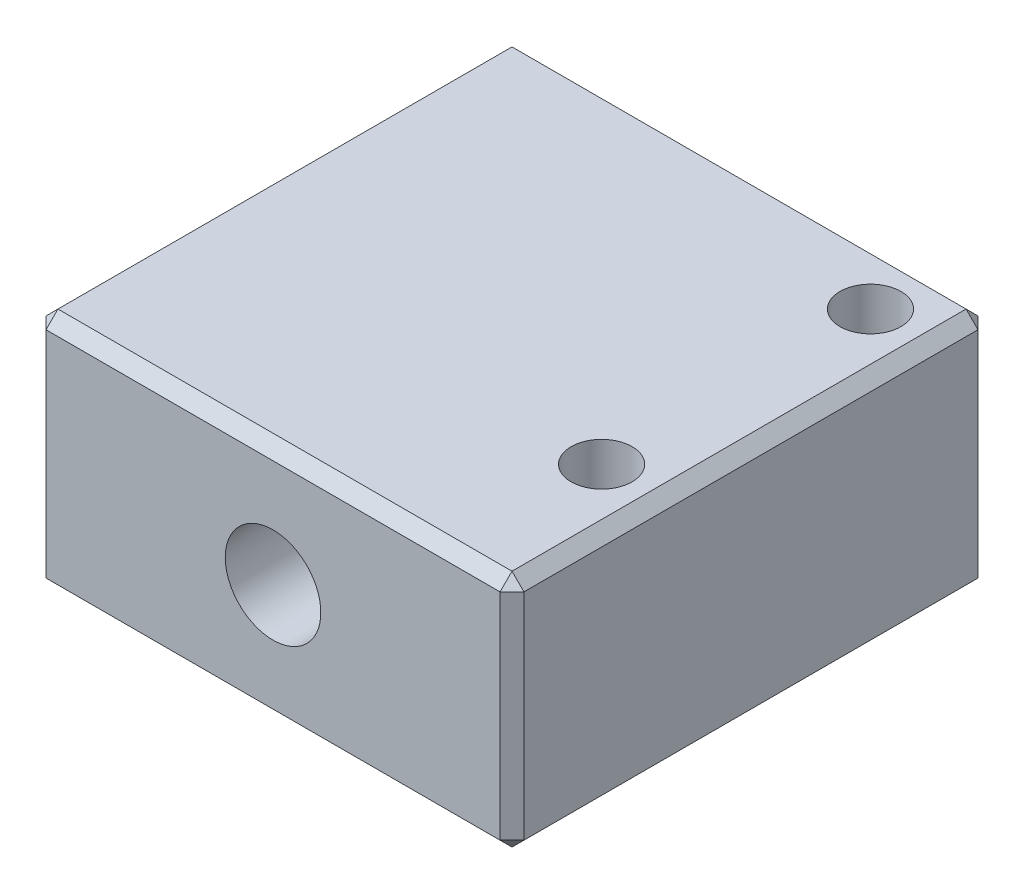
ISO-10303-21;
HEADER;
FILE_DESCRIPTION(('STEP AP214'),'2;1');
FILE_NAME('part.step','',(''),(''),'','','');
FILE_SCHEMA(('AUTOMOTIVE_DESIGN { 1 0 10303 214 1 1 1 1 }'));
ENDSEC;
DATA;
#1=APPLICATION_CONTEXT('core data for automotive mechanical design processes');
#2=APPLICATION_PROTOCOL_DEFINITION('international standard','automotive_design',2000,#1);
#3=PRODUCT_CONTEXT('',#1,'mechanical');
#4=PRODUCT('Part','Part','',(#3));
#5=PRODUCT_RELATED_PRODUCT_CATEGORY('part','',(#4));
#6=PRODUCT_DEFINITION_FORMATION('','',#4);
#7=PRODUCT_DEFINITION_CONTEXT('part definition',#1,'design');
#8=PRODUCT_DEFINITION('design','',#6,#7);
#9=PRODUCT_DEFINITION_SHAPE('','',#8);
#10=(LENGTH_UNIT() NAMED_UNIT(*) SI_UNIT(.MILLI.,.METRE.));
#11=(NAMED_UNIT(*) PLANE_ANGLE_UNIT() SI_UNIT($,.RADIAN.));
#12=(NAMED_UNIT(*) SI_UNIT($,.STERADIAN.) SOLID_ANGLE_UNIT());
#13=UNCERTAINTY_MEASURE_WITH_UNIT(LENGTH_MEASURE(1.E-05),#10,'distance_accuracy_value','');
#14=(GEOMETRIC_REPRESENTATION_CONTEXT(3) GLOBAL_UNCERTAINTY_ASSIGNED_CONTEXT((#13)) GLOBAL_UNIT_ASSIGNED_CONTEXT((#10,
#11,#12)) REPRESENTATION_CONTEXT('',''));
#15=CARTESIAN_POINT('',(0.,0.,0.));
#16=DIRECTION('',(0.,0.,1.));
#17=DIRECTION('',(1.,0.,0.));
#18=AXIS2_PLACEMENT_3D('',#15,#16,#17);
#19=CARTESIAN_POINT('',(20.,20.,20.));
#20=DIRECTION('',(-1.,0.,0.));
#21=DIRECTION('',(0.,0.,1.));
#22=AXIS2_PLACEMENT_3D('',#19,#20,#21);
#23=PLANE('',#22);
#24=DIRECTION('',(0.,0.,-1.));
#25=VECTOR('',#24,1.);
#26=CARTESIAN_POINT('',(20.,0.999999999999994,-20.));
#27=LINE('',#26,#25);
#28=CARTESIAN_POINT('',(20.,0.999999999999994,19.));
#29=VERTEX_POINT('',#28);
#30=CARTESIAN_POINT('',(20.,0.999999999999994,-19.));
#31=VERTEX_POINT('',#30);
#32=EDGE_CURVE('E223',#29,#31,#27,.T.);
#33=ORIENTED_EDGE('',*,*,#32,.T.);
#34=DIRECTION('',(0.,1.,0.));
#35=VECTOR('',#34,1.);
#36=CARTESIAN_POINT('',(20.,20.,-19.));
#37=LINE('',#36,#35);
#38=CARTESIAN_POINT('',(20.,19.,-19.));
#39=VERTEX_POINT('',#38);
#40=EDGE_CURVE('E225',#31,#39,#37,.T.);
#41=ORIENTED_EDGE('',*,*,#40,.T.);
#42=DIRECTION('',(0.,0.,1.));
#43=VECTOR('',#42,1.);
#44=CARTESIAN_POINT('',(20.,19.,20.));
#45=LINE('',#44,#43);
#46=CARTESIAN_POINT('',(20.,19.,19.));
#47=VERTEX_POINT('',#46);
#48=EDGE_CURVE('E219',#39,#47,#45,.T.);
#49=ORIENTED_EDGE('',*,*,#48,.T.);
#50=DIRECTION('',(0.,-1.,0.));
#51=VECTOR('',#50,1.);
#52=CARTESIAN_POINT('',(20.,20.,19.));
#53=LINE('',#52,#51);
#54=EDGE_CURVE('E221',#47,#29,#53,.T.);
#55=ORIENTED_EDGE('',*,*,#54,.T.);
#56=EDGE_LOOP('',(#33,#41,#49,#55));
#57=FACE_BOUND('',#56,.T.);
#58=ADVANCED_FACE('F37',(#57),#23,.F.);
#59=CARTESIAN_POINT('',(-20.,20.,-20.));
#60=DIRECTION('',(0.,0.,1.));
#61=DIRECTION('',(1.,0.,0.));
#62=AXIS2_PLACEMENT_3D('',#59,#60,#61);
#63=PLANE('',#62);
#64=CARTESIAN_POINT('',(0.,10.,-20.));
#65=DIRECTION('',(0.,0.,-1.));
#66=DIRECTION('',(-1.,0.,0.));
#67=AXIS2_PLACEMENT_3D('',#64,#65,#66);
#68=CIRCLE('',#67,4.);
#69=CARTESIAN_POINT('',(-4.,10.,-20.));
#70=VERTEX_POINT('',#69);
#71=EDGE_CURVE('E620',#70,#70,#68,.T.);
#72=ORIENTED_EDGE('',*,*,#71,.F.);
#73=EDGE_LOOP('',(#72));
#74=FACE_BOUND('',#73,.T.);
#75=DIRECTION('',(1.,0.,0.));
#76=VECTOR('',#75,1.);
#77=CARTESIAN_POINT('',(-20.,19.,-20.));
#78=LINE('',#77,#76);
#79=CARTESIAN_POINT('',(-19.,19.,-20.));
#80=VERTEX_POINT('',#79);
#81=CARTESIAN_POINT('',(19.,19.,-20.));
#82=VERTEX_POINT('',#81);
#83=EDGE_CURVE('E135',#80,#82,#78,.T.);
#84=ORIENTED_EDGE('',*,*,#83,.T.);
#85=DIRECTION('',(0.,-1.,0.));
#86=VECTOR('',#85,1.);
#87=CARTESIAN_POINT('',(19.,20.,-20.));
#88=LINE('',#87,#86);
#89=CARTESIAN_POINT('',(19.,0.999999999999994,-20.));
#90=VERTEX_POINT('',#89);
#91=EDGE_CURVE('E131',#82,#90,#88,.T.);
#92=ORIENTED_EDGE('',*,*,#91,.T.);
#93=DIRECTION('',(-1.,0.,0.));
#94=VECTOR('',#93,1.);
#95=CARTESIAN_POINT('',(-20.,0.999999999999994,-20.));
#96=LINE('',#95,#94);
#97=CARTESIAN_POINT('',(-19.,0.999999999999994,-20.));
#98=VERTEX_POINT('',#97);
#99=EDGE_CURVE('E125',#90,#98,#96,.T.);
#100=ORIENTED_EDGE('',*,*,#99,.T.);
#101=DIRECTION('',(0.,1.,0.));
#102=VECTOR('',#101,1.);
#103=CARTESIAN_POINT('',(-19.,20.,-20.));
#104=LINE('',#103,#102);
#105=EDGE_CURVE('E128',#98,#80,#104,.T.);
#106=ORIENTED_EDGE('',*,*,#105,.T.);
#107=EDGE_LOOP('',(#84,#92,#100,#106));
#108=FACE_BOUND('',#107,.T.);
#109=ADVANCED_FACE('F127',(#74,#108),#63,.F.);
#110=CARTESIAN_POINT('',(-20.,20.,20.));
#111=DIRECTION('',(1.,0.,0.));
#112=DIRECTION('',(0.,0.,-1.));
#113=AXIS2_PLACEMENT_3D('',#110,#111,#112);
#114=PLANE('',#113);
#115=DIRECTION('',(0.,0.,1.));
#116=VECTOR('',#115,1.);
#117=CARTESIAN_POINT('',(-20.,1.,20.));
#118=LINE('',#117,#116);
#119=CARTESIAN_POINT('',(-20.,1.,-19.));
#120=VERTEX_POINT('',#119);
#121=CARTESIAN_POINT('',(-20.,1.,19.));
#122=VERTEX_POINT('',#121);
#123=EDGE_CURVE('E46',#120,#122,#118,.T.);
#124=ORIENTED_EDGE('',*,*,#123,.T.);
#125=DIRECTION('',(0.,1.,0.));
#126=VECTOR('',#125,1.);
#127=CARTESIAN_POINT('',(-20.,20.,19.));
#128=LINE('',#127,#126);
#129=CARTESIAN_POINT('',(-20.,19.,19.));
#130=VERTEX_POINT('',#129);
#131=EDGE_CURVE('E11',#122,#130,#128,.T.);
#132=ORIENTED_EDGE('',*,*,#131,.T.);
#133=DIRECTION('',(0.,0.,-1.));
#134=VECTOR('',#133,1.);
#135=CARTESIAN_POINT('',(-20.,19.,20.));
#136=LINE('',#135,#134);
#137=CARTESIAN_POINT('',(-20.,19.,-19.));
#138=VERTEX_POINT('',#137);
#139=EDGE_CURVE('E254',#130,#138,#136,.T.);
#140=ORIENTED_EDGE('',*,*,#139,.T.);
#141=DIRECTION('',(0.,-1.,0.));
#142=VECTOR('',#141,1.);
#143=CARTESIAN_POINT('',(-20.,20.,-19.));
#144=LINE('',#143,#142);
#145=EDGE_CURVE('E57',#138,#120,#144,.T.);
#146=ORIENTED_EDGE('',*,*,#145,.T.);
#147=EDGE_LOOP('',(#124,#132,#140,#146));
#148=FACE_BOUND('',#147,.T.);
#149=CARTESIAN_POINT('',(-20.,10.,-10.));
#150=DIRECTION('',(-1.,0.,0.));
#151=DIRECTION('',(0.,0.,1.));
#152=AXIS2_PLACEMENT_3D('',#149,#150,#151);
#153=CIRCLE('',#152,5.6);
#154=CARTESIAN_POINT('',(-20.,10.,-4.4));
#155=VERTEX_POINT('',#154);
#156=EDGE_CURVE('E204',#155,#155,#153,.T.);
#157=ORIENTED_EDGE('',*,*,#156,.F.);
#158=EDGE_LOOP('',(#157));
#159=FACE_BOUND('',#158,.T.);
#160=ADVANCED_FACE('F322',(#148,#159),#114,.F.);
#161=CARTESIAN_POINT('',(-20.,20.,20.));
#162=DIRECTION('',(0.,0.,-1.));
#163=DIRECTION('',(-1.,0.,0.));
#164=AXIS2_PLACEMENT_3D('',#161,#162,#163);
#165=PLANE('',#164);
#166=CARTESIAN_POINT('',(0.,10.,20.));
#167=DIRECTION('',(0.,0.,-1.));
#168=DIRECTION('',(-1.,0.,0.));
#169=AXIS2_PLACEMENT_3D('',#166,#167,#168);
#170=CIRCLE('',#169,4.);
#171=CARTESIAN_POINT('',(-4.,10.,20.));
#172=VERTEX_POINT('',#171);
#173=EDGE_CURVE('E619',#172,#172,#170,.T.);
#174=ORIENTED_EDGE('',*,*,#173,.T.);
#175=EDGE_LOOP('',(#174));
#176=FACE_BOUND('',#175,.T.);
#177=DIRECTION('',(1.,0.,0.));
#178=VECTOR('',#177,1.);
#179=CARTESIAN_POINT('',(20.,0.999999999999994,20.));
#180=LINE('',#179,#178);
#181=CARTESIAN_POINT('',(-19.,0.999999999999994,20.));
#182=VERTEX_POINT('',#181);
#183=CARTESIAN_POINT('',(19.,0.999999999999994,20.));
#184=VERTEX_POINT('',#183);
#185=EDGE_CURVE('E240',#182,#184,#180,.T.);
#186=ORIENTED_EDGE('',*,*,#185,.T.);
#187=DIRECTION('',(0.,1.,0.));
#188=VECTOR('',#187,1.);
#189=CARTESIAN_POINT('',(19.,20.,20.));
#190=LINE('',#189,#188);
#191=CARTESIAN_POINT('',(19.,19.,20.));
#192=VERTEX_POINT('',#191);
#193=EDGE_CURVE('E242',#184,#192,#190,.T.);
#194=ORIENTED_EDGE('',*,*,#193,.T.);
#195=DIRECTION('',(-1.,0.,0.));
#196=VECTOR('',#195,1.);
#197=CARTESIAN_POINT('',(-20.,19.,20.));
#198=LINE('',#197,#196);
#199=CARTESIAN_POINT('',(-19.,19.,20.));
#200=VERTEX_POINT('',#199);
#201=EDGE_CURVE('E238',#192,#200,#198,.T.);
#202=ORIENTED_EDGE('',*,*,#201,.T.);
#203=DIRECTION('',(0.,-1.,0.));
#204=VECTOR('',#203,1.);
#205=CARTESIAN_POINT('',(-19.,20.,20.));
#206=LINE('',#205,#204);
#207=EDGE_CURVE('E236',#200,#182,#206,.T.);
#208=ORIENTED_EDGE('',*,*,#207,.T.);
#209=EDGE_LOOP('',(#186,#194,#202,#208));
#210=FACE_BOUND('',#209,.T.);
#211=ADVANCED_FACE('F309',(#176,#210),#165,.F.);
#212=CARTESIAN_POINT('',(0.,20.,0.));
#213=DIRECTION('',(0.,-1.,0.));
#214=DIRECTION('',(0.,0.,-1.));
#215=AXIS2_PLACEMENT_3D('',#212,#213,#214);
#216=PLANE('',#215);
#217=CARTESIAN_POINT('',(15.,20.,7.5));
#218=DIRECTION('',(0.,1.,0.));
#219=DIRECTION('',(0.,0.,1.));
#220=AXIS2_PLACEMENT_3D('',#217,#218,#219);
#221=CIRCLE('',#220,2.55269999999999);
#222=CARTESIAN_POINT('',(15.,20.,10.0527));
#223=VERTEX_POINT('',#222);
#224=EDGE_CURVE('E607',#223,#223,#221,.T.);
#225=ORIENTED_EDGE('',*,*,#224,.F.);
#226=EDGE_LOOP('',(#225));
#227=FACE_BOUND('',#226,.T.);
#228=CARTESIAN_POINT('',(15.,20.,-15.));
#229=DIRECTION('',(0.,1.,0.));
#230=DIRECTION('',(0.,0.,1.));
#231=AXIS2_PLACEMENT_3D('',#228,#229,#230);
#232=CIRCLE('',#231,2.55269999999999);
#233=CARTESIAN_POINT('',(15.,20.,-12.4473));
#234=VERTEX_POINT('',#233);
#235=EDGE_CURVE('E610',#234,#234,#232,.T.);
#236=ORIENTED_EDGE('',*,*,#235,.F.);
#237=EDGE_LOOP('',(#236));
#238=FACE_BOUND('',#237,.T.);
#239=DIRECTION('',(1.,0.,0.));
#240=VECTOR('',#239,1.);
#241=CARTESIAN_POINT('',(0.,20.,19.));
#242=LINE('',#241,#240);
#243=CARTESIAN_POINT('',(-19.,20.,19.));
#244=VERTEX_POINT('',#243);
#245=CARTESIAN_POINT('',(19.,20.,19.));
#246=VERTEX_POINT('',#245);
#247=EDGE_CURVE('E247',#244,#246,#242,.T.);
#248=ORIENTED_EDGE('',*,*,#247,.T.);
#249=DIRECTION('',(0.,0.,-1.));
#250=VECTOR('',#249,1.);
#251=CARTESIAN_POINT('',(19.,20.,0.));
#252=LINE('',#251,#250);
#253=CARTESIAN_POINT('',(19.,20.,-19.));
#254=VERTEX_POINT('',#253);
#255=EDGE_CURVE('E251',#246,#254,#252,.T.);
#256=ORIENTED_EDGE('',*,*,#255,.T.);
#257=DIRECTION('',(-1.,0.,0.));
#258=VECTOR('',#257,1.);
#259=CARTESIAN_POINT('',(0.,20.,-19.));
#260=LINE('',#259,#258);
#261=CARTESIAN_POINT('',(-19.,20.,-19.));
#262=VERTEX_POINT('',#261);
#263=EDGE_CURVE('E249',#254,#262,#260,.T.);
#264=ORIENTED_EDGE('',*,*,#263,.T.);
#265=DIRECTION('',(0.,0.,1.));
#266=VECTOR('',#265,1.);
#267=CARTESIAN_POINT('',(-19.,20.,0.));
#268=LINE('',#267,#266);
#269=EDGE_CURVE('E245',#262,#244,#268,.T.);
#270=ORIENTED_EDGE('',*,*,#269,.T.);
#271=EDGE_LOOP('',(#248,#256,#264,#270));
#272=FACE_BOUND('',#271,.T.);
#273=ADVANCED_FACE('F334',(#227,#238,#272),#216,.F.);
#274=CARTESIAN_POINT('',(0.,0.,0.));
#275=DIRECTION('',(0.,-1.,0.));
#276=DIRECTION('',(0.,0.,-1.));
#277=AXIS2_PLACEMENT_3D('',#274,#275,#276);
#278=PLANE('',#277);
#279=CARTESIAN_POINT('',(15.,0.,7.5));
#280=DIRECTION('',(0.,1.,0.));
#281=DIRECTION('',(0.,0.,1.));
#282=AXIS2_PLACEMENT_3D('',#279,#280,#281);
#283=CIRCLE('',#282,2.55269999999999);
#284=CARTESIAN_POINT('',(15.,0.,10.0527));
#285=VERTEX_POINT('',#284);
#286=EDGE_CURVE('E612',#285,#285,#283,.T.);
#287=ORIENTED_EDGE('',*,*,#286,.T.);
#288=EDGE_LOOP('',(#287));
#289=FACE_BOUND('',#288,.T.);
#290=CARTESIAN_POINT('',(15.,0.,-15.));
#291=DIRECTION('',(0.,1.,0.));
#292=DIRECTION('',(0.,0.,1.));
#293=AXIS2_PLACEMENT_3D('',#290,#291,#292);
#294=CIRCLE('',#293,2.55269999999998);
#295=CARTESIAN_POINT('',(15.,0.,-12.4473));
#296=VERTEX_POINT('',#295);
#297=EDGE_CURVE('E261',#296,#296,#294,.T.);
#298=ORIENTED_EDGE('',*,*,#297,.T.);
#299=EDGE_LOOP('',(#298));
#300=FACE_BOUND('',#299,.T.);
#301=DIRECTION('',(1.,0.,0.));
#302=VECTOR('',#301,1.);
#303=CARTESIAN_POINT('',(20.,0.,-19.));
#304=LINE('',#303,#302);
#305=CARTESIAN_POINT('',(-19.,0.,-19.));
#306=VERTEX_POINT('',#305);
#307=CARTESIAN_POINT('',(19.,0.,-19.));
#308=VERTEX_POINT('',#307);
#309=EDGE_CURVE('E157',#306,#308,#304,.T.);
#310=ORIENTED_EDGE('',*,*,#309,.T.);
#311=DIRECTION('',(0.,0.,1.));
#312=VECTOR('',#311,1.);
#313=CARTESIAN_POINT('',(19.,0.,20.));
#314=LINE('',#313,#312);
#315=CARTESIAN_POINT('',(19.,0.,19.));
#316=VERTEX_POINT('',#315);
#317=EDGE_CURVE('E233',#308,#316,#314,.T.);
#318=ORIENTED_EDGE('',*,*,#317,.T.);
#319=DIRECTION('',(-1.,0.,0.));
#320=VECTOR('',#319,1.);
#321=CARTESIAN_POINT('',(-20.,0.,19.));
#322=LINE('',#321,#320);
#323=CARTESIAN_POINT('',(-19.,0.,19.));
#324=VERTEX_POINT('',#323);
#325=EDGE_CURVE('E231',#316,#324,#322,.T.);
#326=ORIENTED_EDGE('',*,*,#325,.T.);
#327=DIRECTION('',(0.,0.,-1.));
#328=VECTOR('',#327,1.);
#329=CARTESIAN_POINT('',(-19.,0.,-20.));
#330=LINE('',#329,#328);
#331=EDGE_CURVE('E228',#324,#306,#330,.T.);
#332=ORIENTED_EDGE('',*,*,#331,.T.);
#333=EDGE_LOOP('',(#310,#318,#326,#332));
#334=FACE_BOUND('',#333,.T.);
#335=ADVANCED_FACE('F297',(#289,#300,#334),#278,.T.);
#336=CARTESIAN_POINT('',(-10.,10.,-10.));
#337=DIRECTION('',(-1.,0.,0.));
#338=DIRECTION('',(0.,0.,1.));
#339=AXIS2_PLACEMENT_3D('',#336,#337,#338);
#340=CYLINDRICAL_SURFACE('',#339,5.6);
#341=CARTESIAN_POINT('',(-10.,10.,-10.));
#342=DIRECTION('',(-1.,0.,0.));
#343=DIRECTION('',(0.,0.,1.));
#344=AXIS2_PLACEMENT_3D('',#341,#342,#343);
#345=CIRCLE('',#344,5.6);
#346=CARTESIAN_POINT('',(-10.,10.,-4.4));
#347=VERTEX_POINT('',#346);
#348=EDGE_CURVE('E146',#347,#347,#345,.T.);
#349=ORIENTED_EDGE('',*,*,#348,.F.);
#350=EDGE_LOOP('',(#349));
#351=FACE_BOUND('',#350,.T.);
#352=ORIENTED_EDGE('',*,*,#156,.T.);
#353=EDGE_LOOP('',(#352));
#354=FACE_BOUND('',#353,.T.);
#355=ADVANCED_FACE('F517',(#351,#354),#340,.F.);
#356=CARTESIAN_POINT('',(-10.,10.,-10.));
#357=DIRECTION('',(-1.,0.,0.));
#358=DIRECTION('',(0.,0.,1.));
#359=AXIS2_PLACEMENT_3D('',#356,#357,#358);
#360=PLANE('',#359);
#361=ORIENTED_EDGE('',*,*,#348,.T.);
#362=EDGE_LOOP('',(#361));
#363=FACE_BOUND('',#362,.T.);
#364=ADVANCED_FACE('F342',(#363),#360,.T.);
#365=CARTESIAN_POINT('',(-19.,20.,20.));
#366=DIRECTION('',(0.70710678118655,0.,-0.707106781186545));
#367=DIRECTION('',(0.,-1.,0.));
#368=AXIS2_PLACEMENT_3D('',#365,#366,#367);
#369=PLANE('',#368);
#370=DIRECTION('',(-0.707106781186545,0.,-0.70710678118655));
#371=VECTOR('',#370,1.);
#372=CARTESIAN_POINT('',(-19.,19.,20.));
#373=LINE('',#372,#371);
#374=EDGE_CURVE('E41',#130,#200,#373,.F.);
#375=ORIENTED_EDGE('',*,*,#374,.F.);
#376=ORIENTED_EDGE('',*,*,#131,.F.);
#377=DIRECTION('',(0.707106781186545,0.,0.70710678118655));
#378=VECTOR('',#377,1.);
#379=CARTESIAN_POINT('',(-19.5,0.999999999999997,19.5));
#380=LINE('',#379,#378);
#381=EDGE_CURVE('E197',#182,#122,#380,.F.);
#382=ORIENTED_EDGE('',*,*,#381,.F.);
#383=ORIENTED_EDGE('',*,*,#207,.F.);
#384=EDGE_LOOP('',(#375,#376,#382,#383));
#385=FACE_BOUND('',#384,.T.);
#386=ADVANCED_FACE('F39',(#385),#369,.F.);
#387=CARTESIAN_POINT('',(-19.,19.,20.));
#388=DIRECTION('',(-0.57735026918963,0.577350269189622,0.577350269189626));
#389=DIRECTION('',(0.707106781186545,0.,0.70710678118655));
#390=AXIS2_PLACEMENT_3D('',#387,#388,#389);
#391=PLANE('',#390);
#392=DIRECTION('',(0.707106781186545,0.70710678118655,0.));
#393=VECTOR('',#392,1.);
#394=CARTESIAN_POINT('',(-19.5,19.5,19.));
#395=LINE('',#394,#393);
#396=EDGE_CURVE('E192',#130,#244,#395,.T.);
#397=ORIENTED_EDGE('',*,*,#396,.F.);
#398=ORIENTED_EDGE('',*,*,#374,.T.);
#399=DIRECTION('',(0.,-0.70710678118655,0.707106781186545));
#400=VECTOR('',#399,1.);
#401=CARTESIAN_POINT('',(-19.,19.,20.));
#402=LINE('',#401,#400);
#403=EDGE_CURVE('E195',#244,#200,#402,.T.);
#404=ORIENTED_EDGE('',*,*,#403,.F.);
#405=EDGE_LOOP('',(#397,#398,#404));
#406=FACE_BOUND('',#405,.T.);
#407=ADVANCED_FACE('F335',(#406),#391,.T.);
#408=CARTESIAN_POINT('',(-19.,0.,19.));
#409=DIRECTION('',(-0.57735026918963,-0.577350269189626,0.577350269189622));
#410=DIRECTION('',(0.707106781186545,-0.70710678118655,0.));
#411=AXIS2_PLACEMENT_3D('',#408,#409,#410);
#412=PLANE('',#411);
#413=DIRECTION('',(0.,0.707106781186545,0.70710678118655));
#414=VECTOR('',#413,1.);
#415=CARTESIAN_POINT('',(-19.,0.,19.));
#416=LINE('',#415,#414);
#417=EDGE_CURVE('E186',#182,#324,#416,.F.);
#418=ORIENTED_EDGE('',*,*,#417,.F.);
#419=ORIENTED_EDGE('',*,*,#381,.T.);
#420=DIRECTION('',(0.707106781186545,-0.70710678118655,0.));
#421=VECTOR('',#420,1.);
#422=CARTESIAN_POINT('',(-19.,0.,19.));
#423=LINE('',#422,#421);
#424=EDGE_CURVE('E189',#324,#122,#423,.F.);
#425=ORIENTED_EDGE('',*,*,#424,.F.);
#426=EDGE_LOOP('',(#418,#419,#425));
#427=FACE_BOUND('',#426,.T.);
#428=ADVANCED_FACE('F302',(#427),#412,.T.);
#429=CARTESIAN_POINT('',(0.,20.,19.));
#430=DIRECTION('',(0.,-0.707106781186545,-0.70710678118655));
#431=DIRECTION('',(1.,0.,0.));
#432=AXIS2_PLACEMENT_3D('',#429,#430,#431);
#433=PLANE('',#432);
#434=ORIENTED_EDGE('',*,*,#403,.T.);
#435=ORIENTED_EDGE('',*,*,#201,.F.);
#436=DIRECTION('',(0.,0.70710678118655,-0.707106781186545));
#437=VECTOR('',#436,1.);
#438=CARTESIAN_POINT('',(19.,19.,20.));
#439=LINE('',#438,#437);
#440=EDGE_CURVE('E181',#246,#192,#439,.F.);
#441=ORIENTED_EDGE('',*,*,#440,.F.);
#442=ORIENTED_EDGE('',*,*,#247,.F.);
#443=EDGE_LOOP('',(#434,#435,#441,#442));
#444=FACE_BOUND('',#443,.T.);
#445=ADVANCED_FACE('F319',(#444),#433,.F.);
#446=CARTESIAN_POINT('',(-19.,20.,0.));
#447=DIRECTION('',(0.70710678118655,-0.707106781186545,0.));
#448=DIRECTION('',(0.,0.,1.));
#449=AXIS2_PLACEMENT_3D('',#446,#447,#448);
#450=PLANE('',#449);
#451=ORIENTED_EDGE('',*,*,#396,.T.);
#452=ORIENTED_EDGE('',*,*,#269,.F.);
#453=DIRECTION('',(-0.707106781186545,-0.70710678118655,0.));
#454=VECTOR('',#453,1.);
#455=CARTESIAN_POINT('',(-19.,20.,-19.));
#456=LINE('',#455,#454);
#457=EDGE_CURVE('E178',#138,#262,#456,.F.);
#458=ORIENTED_EDGE('',*,*,#457,.F.);
#459=ORIENTED_EDGE('',*,*,#139,.F.);
#460=EDGE_LOOP('',(#451,#452,#458,#459));
#461=FACE_BOUND('',#460,.T.);
#462=ADVANCED_FACE('F327',(#461),#450,.F.);
#463=CARTESIAN_POINT('',(-20.,20.,-19.));
#464=DIRECTION('',(0.70710678118655,0.,0.707106781186545));
#465=DIRECTION('',(0.,-1.,0.));
#466=AXIS2_PLACEMENT_3D('',#463,#464,#465);
#467=PLANE('',#466);
#468=DIRECTION('',(-0.707106781186545,0.,0.70710678118655));
#469=VECTOR('',#468,1.);
#470=CARTESIAN_POINT('',(-19.,0.999999999999994,-20.));
#471=LINE('',#470,#469);
#472=EDGE_CURVE('E141',#120,#98,#471,.F.);
#473=ORIENTED_EDGE('',*,*,#472,.F.);
#474=ORIENTED_EDGE('',*,*,#145,.F.);
#475=DIRECTION('',(0.707106781186545,0.,-0.70710678118655));
#476=VECTOR('',#475,1.);
#477=CARTESIAN_POINT('',(-19.5,19.,-19.5));
#478=LINE('',#477,#476);
#479=EDGE_CURVE('E144',#80,#138,#478,.F.);
#480=ORIENTED_EDGE('',*,*,#479,.F.);
#481=ORIENTED_EDGE('',*,*,#105,.F.);
#482=EDGE_LOOP('',(#473,#474,#480,#481));
#483=FACE_BOUND('',#482,.T.);
#484=ADVANCED_FACE('F140',(#483),#467,.F.);
#485=CARTESIAN_POINT('',(-20.,1.,20.));
#486=DIRECTION('',(-0.70710678118655,-0.707106781186545,0.));
#487=DIRECTION('',(0.,0.,-1.));
#488=AXIS2_PLACEMENT_3D('',#485,#486,#487);
#489=PLANE('',#488);
#490=ORIENTED_EDGE('',*,*,#424,.T.);
#491=ORIENTED_EDGE('',*,*,#123,.F.);
#492=DIRECTION('',(-0.707106781186545,0.70710678118655,0.));
#493=VECTOR('',#492,1.);
#494=CARTESIAN_POINT('',(-19.5,0.5,-19.));
#495=LINE('',#494,#493);
#496=EDGE_CURVE('E154',#306,#120,#495,.T.);
#497=ORIENTED_EDGE('',*,*,#496,.F.);
#498=ORIENTED_EDGE('',*,*,#331,.F.);
#499=EDGE_LOOP('',(#490,#491,#497,#498));
#500=FACE_BOUND('',#499,.T.);
#501=ADVANCED_FACE('F301',(#500),#489,.T.);
#502=CARTESIAN_POINT('',(-20.,0.999999999999994,20.));
#503=DIRECTION('',(0.,-0.70710678118655,0.707106781186545));
#504=DIRECTION('',(-1.,0.,0.));
#505=AXIS2_PLACEMENT_3D('',#502,#503,#504);
#506=PLANE('',#505);
#507=ORIENTED_EDGE('',*,*,#417,.T.);
#508=ORIENTED_EDGE('',*,*,#325,.F.);
#509=DIRECTION('',(0.,-0.707106781186545,-0.70710678118655));
#510=VECTOR('',#509,1.);
#511=CARTESIAN_POINT('',(19.,0.,19.));
#512=LINE('',#511,#510);
#513=EDGE_CURVE('E173',#184,#316,#512,.T.);
#514=ORIENTED_EDGE('',*,*,#513,.F.);
#515=ORIENTED_EDGE('',*,*,#185,.F.);
#516=EDGE_LOOP('',(#507,#508,#514,#515));
#517=FACE_BOUND('',#516,.T.);
#518=ADVANCED_FACE('F306',(#517),#506,.T.);
#519=CARTESIAN_POINT('',(20.,20.,19.));
#520=DIRECTION('',(-0.707106781186545,0.,-0.70710678118655));
#521=DIRECTION('',(0.,-1.,0.));
#522=AXIS2_PLACEMENT_3D('',#519,#520,#521);
#523=PLANE('',#522);
#524=DIRECTION('',(-0.70710678118655,0.,0.707106781186545));
#525=VECTOR('',#524,1.);
#526=CARTESIAN_POINT('',(19.,19.,20.));
#527=LINE('',#526,#525);
#528=EDGE_CURVE('E183',#192,#47,#527,.F.);
#529=ORIENTED_EDGE('',*,*,#528,.F.);
#530=ORIENTED_EDGE('',*,*,#193,.F.);
#531=DIRECTION('',(0.70710678118655,0.,-0.707106781186545));
#532=VECTOR('',#531,1.);
#533=CARTESIAN_POINT('',(19.5,0.999999999999994,19.5));
#534=LINE('',#533,#532);
#535=EDGE_CURVE('E170',#29,#184,#534,.F.);
#536=ORIENTED_EDGE('',*,*,#535,.F.);
#537=ORIENTED_EDGE('',*,*,#54,.F.);
#538=EDGE_LOOP('',(#529,#530,#536,#537));
#539=FACE_BOUND('',#538,.T.);
#540=ADVANCED_FACE('F314',(#539),#523,.F.);
#541=CARTESIAN_POINT('',(19.,19.,20.));
#542=DIRECTION('',(0.577350269189626,0.577350269189622,0.57735026918963));
#543=DIRECTION('',(0.70710678118655,0.,-0.707106781186545));
#544=AXIS2_PLACEMENT_3D('',#541,#542,#543);
#545=PLANE('',#544);
#546=ORIENTED_EDGE('',*,*,#440,.T.);
#547=ORIENTED_EDGE('',*,*,#528,.T.);
#548=DIRECTION('',(0.707106781186545,-0.70710678118655,0.));
#549=VECTOR('',#548,1.);
#550=CARTESIAN_POINT('',(19.5,19.5,19.));
#551=LINE('',#550,#549);
#552=EDGE_CURVE('E162',#246,#47,#551,.T.);
#553=ORIENTED_EDGE('',*,*,#552,.F.);
#554=EDGE_LOOP('',(#546,#547,#553));
#555=FACE_BOUND('',#554,.T.);
#556=ADVANCED_FACE('F375',(#555),#545,.T.);
#557=CARTESIAN_POINT('',(-19.,20.,-19.));
#558=DIRECTION('',(-0.57735026918963,0.577350269189622,-0.577350269189626));
#559=DIRECTION('',(-0.707106781186545,0.,0.70710678118655));
#560=AXIS2_PLACEMENT_3D('',#557,#558,#559);
#561=PLANE('',#560);
#562=ORIENTED_EDGE('',*,*,#479,.T.);
#563=ORIENTED_EDGE('',*,*,#457,.T.);
#564=DIRECTION('',(0.,0.70710678118655,0.707106781186545));
#565=VECTOR('',#564,1.);
#566=CARTESIAN_POINT('',(-19.,20.,-19.));
#567=LINE('',#566,#565);
#568=EDGE_CURVE('E158',#80,#262,#567,.T.);
#569=ORIENTED_EDGE('',*,*,#568,.F.);
#570=EDGE_LOOP('',(#562,#563,#569));
#571=FACE_BOUND('',#570,.T.);
#572=ADVANCED_FACE('F329',(#571),#561,.T.);
#573=CARTESIAN_POINT('',(-19.,0.999999999999994,-20.));
#574=DIRECTION('',(-0.57735026918963,-0.577350269189626,-0.577350269189622));
#575=DIRECTION('',(0.707106781186545,-0.70710678118655,0.));
#576=AXIS2_PLACEMENT_3D('',#573,#574,#575);
#577=PLANE('',#576);
#578=ORIENTED_EDGE('',*,*,#496,.T.);
#579=ORIENTED_EDGE('',*,*,#472,.T.);
#580=DIRECTION('',(0.,-0.707106781186545,0.70710678118655));
#581=VECTOR('',#580,1.);
#582=CARTESIAN_POINT('',(-19.,0.999999999999994,-20.));
#583=LINE('',#582,#581);
#584=EDGE_CURVE('E151',#306,#98,#583,.F.);
#585=ORIENTED_EDGE('',*,*,#584,.F.);
#586=EDGE_LOOP('',(#578,#579,#585));
#587=FACE_BOUND('',#586,.T.);
#588=ADVANCED_FACE('F150',(#587),#577,.T.);
#589=CARTESIAN_POINT('',(19.,0.,19.));
#590=DIRECTION('',(0.577350269189622,-0.57735026918963,0.577350269189626));
#591=DIRECTION('',(0.,-0.707106781186545,-0.70710678118655));
#592=AXIS2_PLACEMENT_3D('',#589,#590,#591);
#593=PLANE('',#592);
#594=ORIENTED_EDGE('',*,*,#535,.T.);
#595=ORIENTED_EDGE('',*,*,#513,.T.);
#596=DIRECTION('',(0.70710678118655,0.707106781186545,0.));
#597=VECTOR('',#596,1.);
#598=CARTESIAN_POINT('',(19.,0.,19.));
#599=LINE('',#598,#597);
#600=EDGE_CURVE('E159',#29,#316,#599,.F.);
#601=ORIENTED_EDGE('',*,*,#600,.F.);
#602=EDGE_LOOP('',(#594,#595,#601));
#603=FACE_BOUND('',#602,.T.);
#604=ADVANCED_FACE('F367',(#603),#593,.T.);
#605=CARTESIAN_POINT('',(19.,20.,0.));
#606=DIRECTION('',(-0.70710678118655,-0.707106781186545,0.));
#607=DIRECTION('',(0.,0.,-1.));
#608=AXIS2_PLACEMENT_3D('',#605,#606,#607);
#609=PLANE('',#608);
#610=ORIENTED_EDGE('',*,*,#552,.T.);
#611=ORIENTED_EDGE('',*,*,#48,.F.);
#612=DIRECTION('',(-0.707106781186545,0.70710678118655,0.));
#613=VECTOR('',#612,1.);
#614=CARTESIAN_POINT('',(20.,19.,-19.));
#615=LINE('',#614,#613);
#616=EDGE_CURVE('E164',#254,#39,#615,.F.);
#617=ORIENTED_EDGE('',*,*,#616,.F.);
#618=ORIENTED_EDGE('',*,*,#255,.F.);
#619=EDGE_LOOP('',(#610,#611,#617,#618));
#620=FACE_BOUND('',#619,.T.);
#621=ADVANCED_FACE('F280',(#620),#609,.F.);
#622=CARTESIAN_POINT('',(0.,20.,-19.));
#623=DIRECTION('',(0.,-0.707106781186545,0.70710678118655));
#624=DIRECTION('',(-1.,0.,0.));
#625=AXIS2_PLACEMENT_3D('',#622,#623,#624);
#626=PLANE('',#625);
#627=ORIENTED_EDGE('',*,*,#568,.T.);
#628=ORIENTED_EDGE('',*,*,#263,.F.);
#629=DIRECTION('',(0.,-0.70710678118655,-0.707106781186545));
#630=VECTOR('',#629,1.);
#631=CARTESIAN_POINT('',(19.,19.5,-19.5));
#632=LINE('',#631,#630);
#633=EDGE_CURVE('E269',#82,#254,#632,.F.);
#634=ORIENTED_EDGE('',*,*,#633,.F.);
#635=ORIENTED_EDGE('',*,*,#83,.F.);
#636=EDGE_LOOP('',(#627,#628,#634,#635));
#637=FACE_BOUND('',#636,.T.);
#638=ADVANCED_FACE('F332',(#637),#626,.F.);
#639=CARTESIAN_POINT('',(-20.,0.999999999999994,-20.));
#640=DIRECTION('',(0.,-0.70710678118655,-0.707106781186545));
#641=DIRECTION('',(1.,0.,0.));
#642=AXIS2_PLACEMENT_3D('',#639,#640,#641);
#643=PLANE('',#642);
#644=ORIENTED_EDGE('',*,*,#584,.T.);
#645=ORIENTED_EDGE('',*,*,#99,.F.);
#646=DIRECTION('',(0.,0.707106781186545,-0.70710678118655));
#647=VECTOR('',#646,1.);
#648=CARTESIAN_POINT('',(19.,0.999999999999994,-20.));
#649=LINE('',#648,#647);
#650=EDGE_CURVE('E266',#308,#90,#649,.T.);
#651=ORIENTED_EDGE('',*,*,#650,.F.);
#652=ORIENTED_EDGE('',*,*,#309,.F.);
#653=EDGE_LOOP('',(#644,#645,#651,#652));
#654=FACE_BOUND('',#653,.T.);
#655=ADVANCED_FACE('F156',(#654),#643,.T.);
#656=CARTESIAN_POINT('',(20.,0.999999999999994,20.));
#657=DIRECTION('',(0.707106781186545,-0.70710678118655,0.));
#658=DIRECTION('',(0.,0.,1.));
#659=AXIS2_PLACEMENT_3D('',#656,#657,#658);
#660=PLANE('',#659);
#661=ORIENTED_EDGE('',*,*,#600,.T.);
#662=ORIENTED_EDGE('',*,*,#317,.F.);
#663=DIRECTION('',(-0.70710678118655,-0.707106781186545,0.));
#664=VECTOR('',#663,1.);
#665=CARTESIAN_POINT('',(19.5,0.499999999999997,-19.));
#666=LINE('',#665,#664);
#667=EDGE_CURVE('E263',#31,#308,#666,.T.);
#668=ORIENTED_EDGE('',*,*,#667,.F.);
#669=ORIENTED_EDGE('',*,*,#32,.F.);
#670=EDGE_LOOP('',(#661,#662,#668,#669));
#671=FACE_BOUND('',#670,.T.);
#672=ADVANCED_FACE('F294',(#671),#660,.T.);
#673=CARTESIAN_POINT('',(20.,19.,-19.));
#674=DIRECTION('',(0.57735026918963,0.577350269189622,-0.577350269189626));
#675=DIRECTION('',(-0.707106781186545,0.,-0.70710678118655));
#676=AXIS2_PLACEMENT_3D('',#673,#674,#675);
#677=PLANE('',#676);
#678=ORIENTED_EDGE('',*,*,#633,.T.);
#679=ORIENTED_EDGE('',*,*,#616,.T.);
#680=DIRECTION('',(0.707106781186545,0.,0.70710678118655));
#681=VECTOR('',#680,1.);
#682=CARTESIAN_POINT('',(20.,19.,-19.));
#683=LINE('',#682,#681);
#684=EDGE_CURVE('E260',#82,#39,#683,.T.);
#685=ORIENTED_EDGE('',*,*,#684,.F.);
#686=EDGE_LOOP('',(#678,#679,#685));
#687=FACE_BOUND('',#686,.T.);
#688=ADVANCED_FACE('F275',(#687),#677,.T.);
#689=CARTESIAN_POINT('',(19.,0.999999999999994,-20.));
#690=DIRECTION('',(0.577350269189626,-0.57735026918963,-0.577350269189622));
#691=DIRECTION('',(0.70710678118655,0.707106781186545,0.));
#692=AXIS2_PLACEMENT_3D('',#689,#690,#691);
#693=PLANE('',#692);
#694=ORIENTED_EDGE('',*,*,#667,.T.);
#695=ORIENTED_EDGE('',*,*,#650,.T.);
#696=DIRECTION('',(-0.707106781186545,0.,-0.70710678118655));
#697=VECTOR('',#696,1.);
#698=CARTESIAN_POINT('',(19.,0.999999999999994,-20.));
#699=LINE('',#698,#697);
#700=EDGE_CURVE('E258',#31,#90,#699,.T.);
#701=ORIENTED_EDGE('',*,*,#700,.F.);
#702=EDGE_LOOP('',(#694,#695,#701));
#703=FACE_BOUND('',#702,.T.);
#704=ADVANCED_FACE('F291',(#703),#693,.T.);
#705=CARTESIAN_POINT('',(19.,20.,-20.));
#706=DIRECTION('',(-0.70710678118655,0.,0.707106781186545));
#707=DIRECTION('',(0.,-1.,0.));
#708=AXIS2_PLACEMENT_3D('',#705,#706,#707);
#709=PLANE('',#708);
#710=ORIENTED_EDGE('',*,*,#684,.T.);
#711=ORIENTED_EDGE('',*,*,#40,.F.);
#712=ORIENTED_EDGE('',*,*,#700,.T.);
#713=ORIENTED_EDGE('',*,*,#91,.F.);
#714=EDGE_LOOP('',(#710,#711,#712,#713));
#715=FACE_BOUND('',#714,.T.);
#716=ADVANCED_FACE('F289',(#715),#709,.F.);
#717=CARTESIAN_POINT('',(15.,20.,-15.));
#718=DIRECTION('',(0.,1.,0.));
#719=DIRECTION('',(0.,0.,1.));
#720=AXIS2_PLACEMENT_3D('',#717,#718,#719);
#721=CYLINDRICAL_SURFACE('',#720,2.55269999999999);
#722=ORIENTED_EDGE('',*,*,#297,.F.);
#723=EDGE_LOOP('',(#722));
#724=FACE_BOUND('',#723,.T.);
#725=ORIENTED_EDGE('',*,*,#235,.T.);
#726=EDGE_LOOP('',(#725));
#727=FACE_BOUND('',#726,.T.);
#728=ADVANCED_FACE('F354',(#724,#727),#721,.F.);
#729=CARTESIAN_POINT('',(15.,20.,7.5));
#730=DIRECTION('',(0.,1.,0.));
#731=DIRECTION('',(0.,0.,1.));
#732=AXIS2_PLACEMENT_3D('',#729,#730,#731);
#733=CYLINDRICAL_SURFACE('',#732,2.55269999999999);
#734=ORIENTED_EDGE('',*,*,#286,.F.);
#735=EDGE_LOOP('',(#734));
#736=FACE_BOUND('',#735,.T.);
#737=ORIENTED_EDGE('',*,*,#224,.T.);
#738=EDGE_LOOP('',(#737));
#739=FACE_BOUND('',#738,.T.);
#740=ADVANCED_FACE('F464',(#736,#739),#733,.F.);
#741=CARTESIAN_POINT('',(0.,10.,20.));
#742=DIRECTION('',(0.,0.,-1.));
#743=DIRECTION('',(-1.,0.,0.));
#744=AXIS2_PLACEMENT_3D('',#741,#742,#743);
#745=CYLINDRICAL_SURFACE('',#744,4.);
#746=ORIENTED_EDGE('',*,*,#173,.F.);
#747=EDGE_LOOP('',(#746));
#748=FACE_BOUND('',#747,.T.);
#749=ORIENTED_EDGE('',*,*,#71,.T.);
#750=EDGE_LOOP('',(#749));
#751=FACE_BOUND('',#750,.T.);
#752=ADVANCED_FACE('F472',(#748,#751),#745,.F.);
#753=CLOSED_SHELL('',(#58,#109,#160,#211,#273,#335,#355,#364,#386,#407,#428,#445,#462,#484,#501,
#518,#540,#556,#572,#588,#604,#621,#638,#655,#672,#688,#704,#716,#728,#740,#752));
#754=MANIFOLD_SOLID_BREP('B2',#753);
#755=ADVANCED_BREP_SHAPE_REPRESENTATION('',(#18,#754),#14);
#756=SHAPE_DEFINITION_REPRESENTATION(#9,#755);
ENDSEC;
END-ISO-10303-21;
